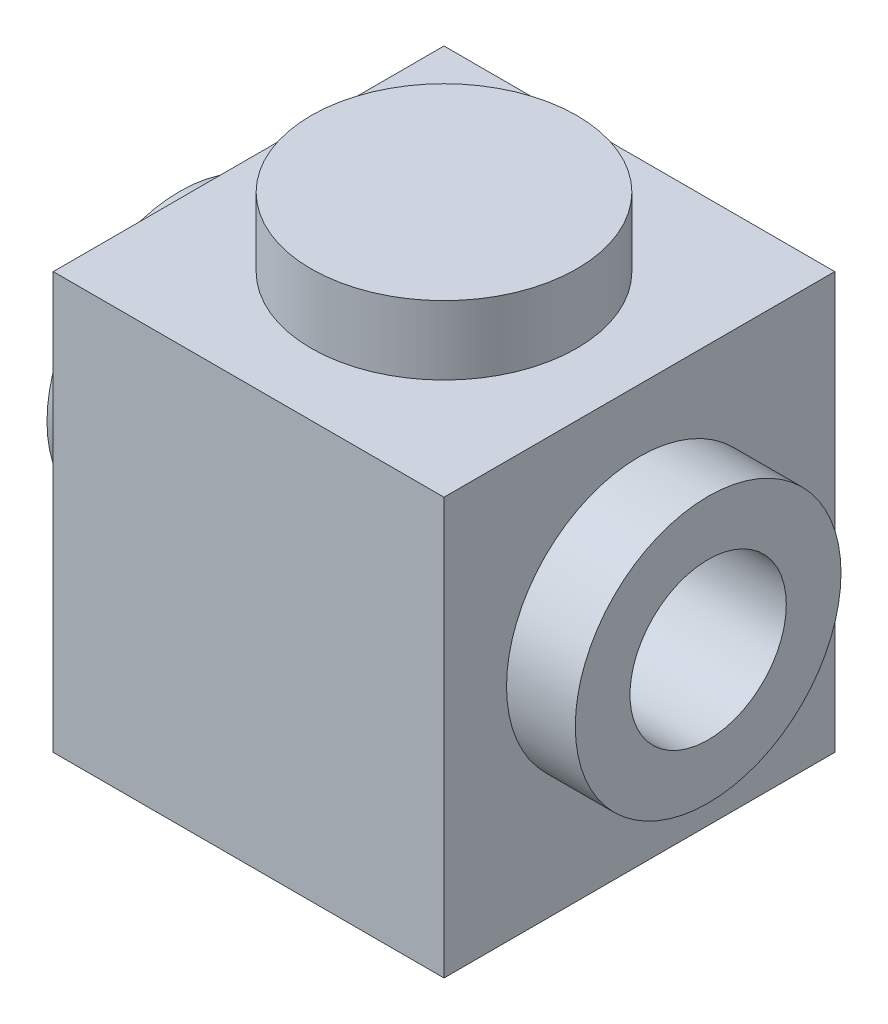
ISO-10303-21;
HEADER;
FILE_DESCRIPTION(('STEP AP214'),'2;1');
FILE_NAME('part.step','',(''),(''),'','','');
FILE_SCHEMA(('AUTOMOTIVE_DESIGN { 1 0 10303 214 1 1 1 1 }'));
ENDSEC;
DATA;
#1=APPLICATION_CONTEXT('core data for automotive mechanical design processes');
#2=APPLICATION_PROTOCOL_DEFINITION('international standard','automotive_design',2000,#1);
#3=PRODUCT_CONTEXT('',#1,'mechanical');
#4=PRODUCT('Part','Part','',(#3));
#5=PRODUCT_RELATED_PRODUCT_CATEGORY('part','',(#4));
#6=PRODUCT_DEFINITION_FORMATION('','',#4);
#7=PRODUCT_DEFINITION_CONTEXT('part definition',#1,'design');
#8=PRODUCT_DEFINITION('design','',#6,#7);
#9=PRODUCT_DEFINITION_SHAPE('','',#8);
#10=(LENGTH_UNIT() NAMED_UNIT(*) SI_UNIT(.MILLI.,.METRE.));
#11=(NAMED_UNIT(*) PLANE_ANGLE_UNIT() SI_UNIT($,.RADIAN.));
#12=(NAMED_UNIT(*) SI_UNIT($,.STERADIAN.) SOLID_ANGLE_UNIT());
#13=UNCERTAINTY_MEASURE_WITH_UNIT(LENGTH_MEASURE(1.E-05),#10,'distance_accuracy_value','');
#14=(GEOMETRIC_REPRESENTATION_CONTEXT(3) GLOBAL_UNCERTAINTY_ASSIGNED_CONTEXT((#13)) GLOBAL_UNIT_ASSIGNED_CONTEXT((#10,
#11,#12)) REPRESENTATION_CONTEXT('',''));
#15=CARTESIAN_POINT('',(0.,0.,0.));
#16=DIRECTION('',(0.,0.,1.));
#17=DIRECTION('',(1.,0.,0.));
#18=AXIS2_PLACEMENT_3D('',#15,#16,#17);
#19=CARTESIAN_POINT('',(3.96875,4.2291,-3.96875));
#20=DIRECTION('',(-1.,0.,0.));
#21=DIRECTION('',(0.,0.,1.));
#22=AXIS2_PLACEMENT_3D('',#19,#20,#21);
#23=PLANE('',#22);
#24=DIRECTION('',(0.,0.,-1.));
#25=VECTOR('',#24,1.);
#26=CARTESIAN_POINT('',(3.96875,-4.2291,-3.96875));
#27=LINE('',#26,#25);
#28=CARTESIAN_POINT('',(3.96875,-4.2291,3.96875));
#29=VERTEX_POINT('',#28);
#30=CARTESIAN_POINT('',(3.96875,-4.2291,-3.96875));
#31=VERTEX_POINT('',#30);
#32=EDGE_CURVE('E190',#29,#31,#27,.T.);
#33=ORIENTED_EDGE('',*,*,#32,.T.);
#34=DIRECTION('',(0.,-1.,0.));
#35=VECTOR('',#34,1.);
#36=CARTESIAN_POINT('',(3.96875,4.2291,-3.96875));
#37=LINE('',#36,#35);
#38=CARTESIAN_POINT('',(3.96875,4.2291,-3.96875));
#39=VERTEX_POINT('',#38);
#40=EDGE_CURVE('E63',#39,#31,#37,.T.);
#41=ORIENTED_EDGE('',*,*,#40,.F.);
#42=DIRECTION('',(0.,0.,-1.));
#43=VECTOR('',#42,1.);
#44=CARTESIAN_POINT('',(3.96875,4.2291,-3.96875));
#45=LINE('',#44,#43);
#46=CARTESIAN_POINT('',(3.96875,4.2291,3.96875));
#47=VERTEX_POINT('',#46);
#48=EDGE_CURVE('E191',#47,#39,#45,.T.);
#49=ORIENTED_EDGE('',*,*,#48,.F.);
#50=DIRECTION('',(0.,-1.,0.));
#51=VECTOR('',#50,1.);
#52=CARTESIAN_POINT('',(3.96875,4.2291,3.96875));
#53=LINE('',#52,#51);
#54=EDGE_CURVE('E200',#47,#29,#53,.T.);
#55=ORIENTED_EDGE('',*,*,#54,.T.);
#56=EDGE_LOOP('',(#33,#41,#49,#55));
#57=FACE_BOUND('',#56,.T.);
#58=CARTESIAN_POINT('',(3.96875,0.260349999999999,0.));
#59=DIRECTION('',(-1.,0.,0.));
#60=DIRECTION('',(0.,0.,1.));
#61=AXIS2_PLACEMENT_3D('',#58,#59,#60);
#62=CIRCLE('',#61,2.69875);
#63=CARTESIAN_POINT('',(3.96875,0.260349999999999,2.69875));
#64=VERTEX_POINT('',#63);
#65=EDGE_CURVE('E14',#64,#64,#62,.F.);
#66=ORIENTED_EDGE('',*,*,#65,.F.);
#67=EDGE_LOOP('',(#66));
#68=FACE_BOUND('',#67,.T.);
#69=ADVANCED_FACE('F55',(#57,#68),#23,.F.);
#70=CARTESIAN_POINT('',(3.96875,4.2291,3.96875));
#71=DIRECTION('',(0.,1.,0.));
#72=DIRECTION('',(0.,0.,1.));
#73=AXIS2_PLACEMENT_3D('',#70,#71,#72);
#74=PLANE('',#73);
#75=ORIENTED_EDGE('',*,*,#48,.T.);
#76=DIRECTION('',(-1.,0.,0.));
#77=VECTOR('',#76,1.);
#78=CARTESIAN_POINT('',(-3.96875,4.2291,-3.96874999999998));
#79=LINE('',#78,#77);
#80=CARTESIAN_POINT('',(-3.96875,4.2291,-3.96874999999998));
#81=VERTEX_POINT('',#80);
#82=EDGE_CURVE('E120',#39,#81,#79,.T.);
#83=ORIENTED_EDGE('',*,*,#82,.T.);
#84=DIRECTION('',(0.,0.,1.));
#85=VECTOR('',#84,1.);
#86=CARTESIAN_POINT('',(-3.96875,4.2291,-3.96874999999998));
#87=LINE('',#86,#85);
#88=CARTESIAN_POINT('',(-3.96875,4.2291,3.96874999999998));
#89=VERTEX_POINT('',#88);
#90=EDGE_CURVE('E195',#81,#89,#87,.T.);
#91=ORIENTED_EDGE('',*,*,#90,.T.);
#92=DIRECTION('',(1.,0.,0.));
#93=VECTOR('',#92,1.);
#94=CARTESIAN_POINT('',(-3.96875,4.2291,3.96874999999998));
#95=LINE('',#94,#93);
#96=EDGE_CURVE('E84',#89,#47,#95,.T.);
#97=ORIENTED_EDGE('',*,*,#96,.T.);
#98=EDGE_LOOP('',(#75,#83,#91,#97));
#99=FACE_BOUND('',#98,.T.);
#100=CARTESIAN_POINT('',(0.,4.2291,0.));
#101=DIRECTION('',(0.,1.,0.));
#102=DIRECTION('',(0.,0.,1.));
#103=AXIS2_PLACEMENT_3D('',#100,#101,#102);
#104=CIRCLE('',#103,2.69875);
#105=CARTESIAN_POINT('',(0.,4.2291,2.69875));
#106=VERTEX_POINT('',#105);
#107=EDGE_CURVE('E241',#106,#106,#104,.T.);
#108=ORIENTED_EDGE('',*,*,#107,.F.);
#109=EDGE_LOOP('',(#108));
#110=FACE_BOUND('',#109,.T.);
#111=ADVANCED_FACE('F235',(#99,#110),#74,.T.);
#112=CARTESIAN_POINT('',(-3.96875,4.2291,-3.96874999999998));
#113=DIRECTION('',(0.,0.,1.));
#114=DIRECTION('',(1.,0.,0.));
#115=AXIS2_PLACEMENT_3D('',#112,#113,#114);
#116=PLANE('',#115);
#117=DIRECTION('',(-1.,0.,0.));
#118=VECTOR('',#117,1.);
#119=CARTESIAN_POINT('',(-3.96875,-4.2291,-3.96874999999998));
#120=LINE('',#119,#118);
#121=CARTESIAN_POINT('',(-3.96875,-4.2291,-3.96874999999998));
#122=VERTEX_POINT('',#121);
#123=EDGE_CURVE('E204',#31,#122,#120,.T.);
#124=ORIENTED_EDGE('',*,*,#123,.T.);
#125=DIRECTION('',(0.,-1.,0.));
#126=VECTOR('',#125,1.);
#127=CARTESIAN_POINT('',(-3.96875,4.2291,-3.96874999999998));
#128=LINE('',#127,#126);
#129=EDGE_CURVE('E217',#81,#122,#128,.T.);
#130=ORIENTED_EDGE('',*,*,#129,.F.);
#131=ORIENTED_EDGE('',*,*,#82,.F.);
#132=ORIENTED_EDGE('',*,*,#40,.T.);
#133=EDGE_LOOP('',(#124,#130,#131,#132));
#134=FACE_BOUND('',#133,.T.);
#135=ADVANCED_FACE('F222',(#134),#116,.F.);
#136=CARTESIAN_POINT('',(-3.96875,4.2291,-3.96874999999998));
#137=DIRECTION('',(1.,0.,0.));
#138=DIRECTION('',(0.,0.,-1.));
#139=AXIS2_PLACEMENT_3D('',#136,#137,#138);
#140=PLANE('',#139);
#141=CARTESIAN_POINT('',(-3.96875,0.260349999999999,0.));
#142=DIRECTION('',(1.,0.,0.));
#143=DIRECTION('',(0.,0.,-1.));
#144=AXIS2_PLACEMENT_3D('',#141,#142,#143);
#145=CIRCLE('',#144,2.69875);
#146=CARTESIAN_POINT('',(-3.96875,0.260349999999999,-2.69875));
#147=VERTEX_POINT('',#146);
#148=EDGE_CURVE('E412',#147,#147,#145,.T.);
#149=ORIENTED_EDGE('',*,*,#148,.T.);
#150=EDGE_LOOP('',(#149));
#151=FACE_BOUND('',#150,.T.);
#152=DIRECTION('',(0.,0.,1.));
#153=VECTOR('',#152,1.);
#154=CARTESIAN_POINT('',(-3.96875,-4.2291,-3.96874999999998));
#155=LINE('',#154,#153);
#156=CARTESIAN_POINT('',(-3.96875,-4.2291,3.96874999999998));
#157=VERTEX_POINT('',#156);
#158=EDGE_CURVE('E207',#122,#157,#155,.T.);
#159=ORIENTED_EDGE('',*,*,#158,.T.);
#160=DIRECTION('',(0.,-1.,0.));
#161=VECTOR('',#160,1.);
#162=CARTESIAN_POINT('',(-3.96875,4.2291,3.96874999999998));
#163=LINE('',#162,#161);
#164=EDGE_CURVE('E214',#89,#157,#163,.T.);
#165=ORIENTED_EDGE('',*,*,#164,.F.);
#166=ORIENTED_EDGE('',*,*,#90,.F.);
#167=ORIENTED_EDGE('',*,*,#129,.T.);
#168=EDGE_LOOP('',(#159,#165,#166,#167));
#169=FACE_BOUND('',#168,.T.);
#170=ADVANCED_FACE('F232',(#151,#169),#140,.F.);
#171=CARTESIAN_POINT('',(-3.96875,4.2291,3.96874999999998));
#172=DIRECTION('',(0.,0.,-1.));
#173=DIRECTION('',(-1.,0.,0.));
#174=AXIS2_PLACEMENT_3D('',#171,#172,#173);
#175=PLANE('',#174);
#176=DIRECTION('',(1.,0.,0.));
#177=VECTOR('',#176,1.);
#178=CARTESIAN_POINT('',(-3.96875,-4.2291,3.96874999999998));
#179=LINE('',#178,#177);
#180=EDGE_CURVE('E109',#157,#29,#179,.T.);
#181=ORIENTED_EDGE('',*,*,#180,.T.);
#182=ORIENTED_EDGE('',*,*,#54,.F.);
#183=ORIENTED_EDGE('',*,*,#96,.F.);
#184=ORIENTED_EDGE('',*,*,#164,.T.);
#185=EDGE_LOOP('',(#181,#182,#183,#184));
#186=FACE_BOUND('',#185,.T.);
#187=ADVANCED_FACE('F234',(#186),#175,.F.);
#188=CARTESIAN_POINT('',(3.96875,-4.2291,3.96875));
#189=DIRECTION('',(0.,1.,0.));
#190=DIRECTION('',(0.,0.,1.));
#191=AXIS2_PLACEMENT_3D('',#188,#189,#190);
#192=PLANE('',#191);
#193=DIRECTION('',(0.,0.,1.));
#194=VECTOR('',#193,1.);
#195=CARTESIAN_POINT('',(2.69875,-4.2291,-8.87267135623731));
#196=LINE('',#195,#194);
#197=CARTESIAN_POINT('',(2.69875,-4.2291,-2.69875));
#198=VERTEX_POINT('',#197);
#199=CARTESIAN_POINT('',(2.69875,-4.2291,2.69875));
#200=VERTEX_POINT('',#199);
#201=EDGE_CURVE('E171',#198,#200,#196,.T.);
#202=ORIENTED_EDGE('',*,*,#201,.F.);
#203=DIRECTION('',(1.,0.,0.));
#204=VECTOR('',#203,1.);
#205=CARTESIAN_POINT('',(0.,-4.2291,-2.69875));
#206=LINE('',#205,#204);
#207=CARTESIAN_POINT('',(-2.69875,-4.2291,-2.69875000000001));
#208=VERTEX_POINT('',#207);
#209=EDGE_CURVE('E160',#208,#198,#206,.T.);
#210=ORIENTED_EDGE('',*,*,#209,.F.);
#211=DIRECTION('',(0.,0.,-1.));
#212=VECTOR('',#211,1.);
#213=CARTESIAN_POINT('',(-2.69875,-4.2291,-8.87267135623731));
#214=LINE('',#213,#212);
#215=CARTESIAN_POINT('',(-2.69875,-4.2291,2.69874999999999));
#216=VERTEX_POINT('',#215);
#217=EDGE_CURVE('E175',#216,#208,#214,.T.);
#218=ORIENTED_EDGE('',*,*,#217,.F.);
#219=DIRECTION('',(-1.,0.,0.));
#220=VECTOR('',#219,1.);
#221=CARTESIAN_POINT('',(0.,-4.2291,2.69875));
#222=LINE('',#221,#220);
#223=EDGE_CURVE('E72',#200,#216,#222,.T.);
#224=ORIENTED_EDGE('',*,*,#223,.F.);
#225=EDGE_LOOP('',(#202,#210,#218,#224));
#226=FACE_BOUND('',#225,.T.);
#227=ORIENTED_EDGE('',*,*,#32,.F.);
#228=ORIENTED_EDGE('',*,*,#180,.F.);
#229=ORIENTED_EDGE('',*,*,#158,.F.);
#230=ORIENTED_EDGE('',*,*,#123,.F.);
#231=EDGE_LOOP('',(#227,#228,#229,#230));
#232=FACE_BOUND('',#231,.T.);
#233=ADVANCED_FACE('F228',(#226,#232),#192,.F.);
#234=CARTESIAN_POINT('',(3.96875,2.9591,3.96875));
#235=DIRECTION('',(0.,1.,0.));
#236=DIRECTION('',(0.,0.,1.));
#237=AXIS2_PLACEMENT_3D('',#234,#235,#236);
#238=PLANE('',#237);
#239=DIRECTION('',(0.,0.,-1.));
#240=VECTOR('',#239,1.);
#241=CARTESIAN_POINT('',(-2.69875,2.9591,-8.87267135623731));
#242=LINE('',#241,#240);
#243=CARTESIAN_POINT('',(-2.69875,2.9591,2.69874999999999));
#244=VERTEX_POINT('',#243);
#245=CARTESIAN_POINT('',(-2.69875,2.9591,-2.69875000000001));
#246=VERTEX_POINT('',#245);
#247=EDGE_CURVE('E165',#244,#246,#242,.T.);
#248=ORIENTED_EDGE('',*,*,#247,.T.);
#249=DIRECTION('',(1.,0.,0.));
#250=VECTOR('',#249,1.);
#251=CARTESIAN_POINT('',(0.,2.9591,-2.69875));
#252=LINE('',#251,#250);
#253=CARTESIAN_POINT('',(2.69875,2.9591,-2.69875));
#254=VERTEX_POINT('',#253);
#255=EDGE_CURVE('E157',#246,#254,#252,.T.);
#256=ORIENTED_EDGE('',*,*,#255,.T.);
#257=DIRECTION('',(0.,0.,1.));
#258=VECTOR('',#257,1.);
#259=CARTESIAN_POINT('',(2.69875,2.9591,-8.87267135623731));
#260=LINE('',#259,#258);
#261=CARTESIAN_POINT('',(2.69875,2.9591,2.69875));
#262=VERTEX_POINT('',#261);
#263=EDGE_CURVE('E143',#254,#262,#260,.T.);
#264=ORIENTED_EDGE('',*,*,#263,.T.);
#265=DIRECTION('',(-1.,0.,0.));
#266=VECTOR('',#265,1.);
#267=CARTESIAN_POINT('',(0.,2.9591,2.69875));
#268=LINE('',#267,#266);
#269=EDGE_CURVE('E181',#262,#244,#268,.T.);
#270=ORIENTED_EDGE('',*,*,#269,.T.);
#271=EDGE_LOOP('',(#248,#256,#264,#270));
#272=FACE_BOUND('',#271,.T.);
#273=ADVANCED_FACE('F164',(#272),#238,.F.);
#274=CARTESIAN_POINT('',(0.,11.8623177029088,-2.69875));
#275=DIRECTION('',(0.,0.,-1.));
#276=DIRECTION('',(-1.,0.,0.));
#277=AXIS2_PLACEMENT_3D('',#274,#275,#276);
#278=PLANE('',#277);
#279=DIRECTION('',(0.,-1.,0.));
#280=VECTOR('',#279,1.);
#281=CARTESIAN_POINT('',(-2.69875,11.8623177029088,-2.69875000000001));
#282=LINE('',#281,#280);
#283=EDGE_CURVE('E179',#246,#208,#282,.T.);
#284=ORIENTED_EDGE('',*,*,#283,.T.);
#285=ORIENTED_EDGE('',*,*,#209,.T.);
#286=DIRECTION('',(0.,-1.,0.));
#287=VECTOR('',#286,1.);
#288=CARTESIAN_POINT('',(2.69875,11.8623177029088,-2.69875));
#289=LINE('',#288,#287);
#290=EDGE_CURVE('E147',#254,#198,#289,.T.);
#291=ORIENTED_EDGE('',*,*,#290,.F.);
#292=ORIENTED_EDGE('',*,*,#255,.F.);
#293=EDGE_LOOP('',(#284,#285,#291,#292));
#294=FACE_BOUND('',#293,.T.);
#295=ADVANCED_FACE('F156',(#294),#278,.F.);
#296=CARTESIAN_POINT('',(2.69875,11.8623177029088,-8.87267135623731));
#297=DIRECTION('',(1.,0.,0.));
#298=DIRECTION('',(0.,0.,-1.));
#299=AXIS2_PLACEMENT_3D('',#296,#297,#298);
#300=PLANE('',#299);
#301=CARTESIAN_POINT('',(2.69875,0.260349999999999,0.));
#302=DIRECTION('',(1.,0.,0.));
#303=DIRECTION('',(0.,0.,-1.));
#304=AXIS2_PLACEMENT_3D('',#301,#302,#303);
#305=CIRCLE('',#304,1.5875);
#306=CARTESIAN_POINT('',(2.69875,0.260349999999999,-1.5875));
#307=VERTEX_POINT('',#306);
#308=EDGE_CURVE('E409',#307,#307,#305,.T.);
#309=ORIENTED_EDGE('',*,*,#308,.T.);
#310=EDGE_LOOP('',(#309));
#311=FACE_BOUND('',#310,.T.);
#312=ORIENTED_EDGE('',*,*,#290,.T.);
#313=ORIENTED_EDGE('',*,*,#201,.T.);
#314=DIRECTION('',(0.,-1.,0.));
#315=VECTOR('',#314,1.);
#316=CARTESIAN_POINT('',(2.69875,11.8623177029088,2.69875));
#317=LINE('',#316,#315);
#318=EDGE_CURVE('E149',#262,#200,#317,.T.);
#319=ORIENTED_EDGE('',*,*,#318,.F.);
#320=ORIENTED_EDGE('',*,*,#263,.F.);
#321=EDGE_LOOP('',(#312,#313,#319,#320));
#322=FACE_BOUND('',#321,.T.);
#323=ADVANCED_FACE('F145',(#311,#322),#300,.F.);
#324=CARTESIAN_POINT('',(0.,11.8623177029088,2.69875));
#325=DIRECTION('',(0.,0.,1.));
#326=DIRECTION('',(1.,0.,0.));
#327=AXIS2_PLACEMENT_3D('',#324,#325,#326);
#328=PLANE('',#327);
#329=ORIENTED_EDGE('',*,*,#318,.T.);
#330=ORIENTED_EDGE('',*,*,#223,.T.);
#331=DIRECTION('',(0.,-1.,0.));
#332=VECTOR('',#331,1.);
#333=CARTESIAN_POINT('',(-2.69875,11.8623177029088,2.69874999999999));
#334=LINE('',#333,#332);
#335=EDGE_CURVE('E180',#244,#216,#334,.T.);
#336=ORIENTED_EDGE('',*,*,#335,.F.);
#337=ORIENTED_EDGE('',*,*,#269,.F.);
#338=EDGE_LOOP('',(#329,#330,#336,#337));
#339=FACE_BOUND('',#338,.T.);
#340=ADVANCED_FACE('F300',(#339),#328,.F.);
#341=CARTESIAN_POINT('',(-2.69875,11.8623177029088,-8.87267135623731));
#342=DIRECTION('',(-1.,0.,0.));
#343=DIRECTION('',(0.,0.,1.));
#344=AXIS2_PLACEMENT_3D('',#341,#342,#343);
#345=PLANE('',#344);
#346=CARTESIAN_POINT('',(-2.69875,0.260349999999999,0.));
#347=DIRECTION('',(-1.,0.,0.));
#348=DIRECTION('',(0.,0.,1.));
#349=AXIS2_PLACEMENT_3D('',#346,#347,#348);
#350=CIRCLE('',#349,1.5875);
#351=CARTESIAN_POINT('',(-2.69875,0.260349999999999,1.5875));
#352=VERTEX_POINT('',#351);
#353=EDGE_CURVE('E413',#352,#352,#350,.T.);
#354=ORIENTED_EDGE('',*,*,#353,.T.);
#355=EDGE_LOOP('',(#354));
#356=FACE_BOUND('',#355,.T.);
#357=ORIENTED_EDGE('',*,*,#335,.T.);
#358=ORIENTED_EDGE('',*,*,#217,.T.);
#359=ORIENTED_EDGE('',*,*,#283,.F.);
#360=ORIENTED_EDGE('',*,*,#247,.F.);
#361=EDGE_LOOP('',(#357,#358,#359,#360));
#362=FACE_BOUND('',#361,.T.);
#363=ADVANCED_FACE('F260',(#356,#362),#345,.F.);
#364=CARTESIAN_POINT('',(0.,5.6261,0.));
#365=DIRECTION('',(0.,-1.,0.));
#366=DIRECTION('',(0.,0.,-1.));
#367=AXIS2_PLACEMENT_3D('',#364,#365,#366);
#368=CYLINDRICAL_SURFACE('',#367,2.69875);
#369=CARTESIAN_POINT('',(0.,5.6261,0.));
#370=DIRECTION('',(0.,1.,0.));
#371=DIRECTION('',(0.,0.,1.));
#372=AXIS2_PLACEMENT_3D('',#369,#370,#371);
#373=CIRCLE('',#372,2.69875);
#374=CARTESIAN_POINT('',(0.,5.6261,2.69875));
#375=VERTEX_POINT('',#374);
#376=EDGE_CURVE('E244',#375,#375,#373,.T.);
#377=ORIENTED_EDGE('',*,*,#376,.F.);
#378=EDGE_LOOP('',(#377));
#379=FACE_BOUND('',#378,.T.);
#380=ORIENTED_EDGE('',*,*,#107,.T.);
#381=EDGE_LOOP('',(#380));
#382=FACE_BOUND('',#381,.T.);
#383=ADVANCED_FACE('F358',(#379,#382),#368,.T.);
#384=CARTESIAN_POINT('',(0.,5.6261,0.));
#385=DIRECTION('',(0.,1.,0.));
#386=DIRECTION('',(0.,0.,1.));
#387=AXIS2_PLACEMENT_3D('',#384,#385,#386);
#388=PLANE('',#387);
#389=ORIENTED_EDGE('',*,*,#376,.T.);
#390=EDGE_LOOP('',(#389));
#391=FACE_BOUND('',#390,.T.);
#392=ADVANCED_FACE('F351',(#391),#388,.T.);
#393=CARTESIAN_POINT('',(5.36575,0.260349999999999,0.));
#394=DIRECTION('',(-1.,0.,0.));
#395=DIRECTION('',(0.,0.,1.));
#396=AXIS2_PLACEMENT_3D('',#393,#394,#395);
#397=CYLINDRICAL_SURFACE('',#396,2.69875);
#398=CARTESIAN_POINT('',(5.36575,0.260349999999999,0.));
#399=DIRECTION('',(1.,0.,0.));
#400=DIRECTION('',(0.,0.,-1.));
#401=AXIS2_PLACEMENT_3D('',#398,#399,#400);
#402=CIRCLE('',#401,2.69875);
#403=CARTESIAN_POINT('',(5.36575,0.260349999999999,-2.69875));
#404=VERTEX_POINT('',#403);
#405=EDGE_CURVE('E245',#404,#404,#402,.T.);
#406=ORIENTED_EDGE('',*,*,#405,.F.);
#407=EDGE_LOOP('',(#406));
#408=FACE_BOUND('',#407,.T.);
#409=ORIENTED_EDGE('',*,*,#65,.T.);
#410=EDGE_LOOP('',(#409));
#411=FACE_BOUND('',#410,.T.);
#412=ADVANCED_FACE('F345',(#408,#411),#397,.T.);
#413=CARTESIAN_POINT('',(5.36575,0.260349999999999,0.));
#414=DIRECTION('',(1.,0.,0.));
#415=DIRECTION('',(0.,0.,-1.));
#416=AXIS2_PLACEMENT_3D('',#413,#414,#415);
#417=PLANE('',#416);
#418=CARTESIAN_POINT('',(5.36575,0.260349999999999,0.));
#419=DIRECTION('',(1.,0.,0.));
#420=DIRECTION('',(0.,0.,-1.));
#421=AXIS2_PLACEMENT_3D('',#418,#419,#420);
#422=CIRCLE('',#421,1.5875);
#423=CARTESIAN_POINT('',(5.36575,0.260349999999999,-1.5875));
#424=VERTEX_POINT('',#423);
#425=EDGE_CURVE('E429',#424,#424,#422,.T.);
#426=ORIENTED_EDGE('',*,*,#425,.F.);
#427=EDGE_LOOP('',(#426));
#428=FACE_BOUND('',#427,.T.);
#429=ORIENTED_EDGE('',*,*,#405,.T.);
#430=EDGE_LOOP('',(#429));
#431=FACE_BOUND('',#430,.T.);
#432=ADVANCED_FACE('F339',(#428,#431),#417,.T.);
#433=CARTESIAN_POINT('',(-5.36575,0.260349999999999,0.));
#434=DIRECTION('',(1.,0.,0.));
#435=DIRECTION('',(0.,0.,-1.));
#436=AXIS2_PLACEMENT_3D('',#433,#434,#435);
#437=CYLINDRICAL_SURFACE('',#436,2.69875);
#438=CARTESIAN_POINT('',(-5.36575,0.260349999999999,0.));
#439=DIRECTION('',(1.,0.,0.));
#440=DIRECTION('',(0.,0.,-1.));
#441=AXIS2_PLACEMENT_3D('',#438,#439,#440);
#442=CIRCLE('',#441,2.69875);
#443=CARTESIAN_POINT('',(-5.36575,0.260349999999999,-2.69875));
#444=VERTEX_POINT('',#443);
#445=EDGE_CURVE('E252',#444,#444,#442,.T.);
#446=ORIENTED_EDGE('',*,*,#445,.T.);
#447=EDGE_LOOP('',(#446));
#448=FACE_BOUND('',#447,.T.);
#449=ORIENTED_EDGE('',*,*,#148,.F.);
#450=EDGE_LOOP('',(#449));
#451=FACE_BOUND('',#450,.T.);
#452=ADVANCED_FACE('F331',(#448,#451),#437,.T.);
#453=CARTESIAN_POINT('',(-5.36575,0.260349999999999,0.));
#454=DIRECTION('',(-1.,0.,0.));
#455=DIRECTION('',(0.,0.,-1.));
#456=AXIS2_PLACEMENT_3D('',#453,#454,#455);
#457=PLANE('',#456);
#458=CARTESIAN_POINT('',(-5.36575,0.260349999999999,0.));
#459=DIRECTION('',(1.,0.,0.));
#460=DIRECTION('',(0.,0.,-1.));
#461=AXIS2_PLACEMENT_3D('',#458,#459,#460);
#462=CIRCLE('',#461,1.5875);
#463=CARTESIAN_POINT('',(-5.36575,0.260349999999999,-1.5875));
#464=VERTEX_POINT('',#463);
#465=EDGE_CURVE('E419',#464,#464,#462,.T.);
#466=ORIENTED_EDGE('',*,*,#465,.T.);
#467=EDGE_LOOP('',(#466));
#468=FACE_BOUND('',#467,.T.);
#469=ORIENTED_EDGE('',*,*,#445,.F.);
#470=EDGE_LOOP('',(#469));
#471=FACE_BOUND('',#470,.T.);
#472=ADVANCED_FACE('F325',(#468,#471),#457,.T.);
#473=CARTESIAN_POINT('',(-5.36575,0.260349999999999,0.));
#474=DIRECTION('',(1.,0.,0.));
#475=DIRECTION('',(0.,0.,-1.));
#476=AXIS2_PLACEMENT_3D('',#473,#474,#475);
#477=CYLINDRICAL_SURFACE('',#476,1.5875);
#478=ORIENTED_EDGE('',*,*,#465,.F.);
#479=EDGE_LOOP('',(#478));
#480=FACE_BOUND('',#479,.T.);
#481=ORIENTED_EDGE('',*,*,#353,.F.);
#482=EDGE_LOOP('',(#481));
#483=FACE_BOUND('',#482,.T.);
#484=ADVANCED_FACE('F314',(#480,#483),#477,.F.);
#485=ORIENTED_EDGE('',*,*,#425,.T.);
#486=EDGE_LOOP('',(#485));
#487=FACE_BOUND('',#486,.T.);
#488=ORIENTED_EDGE('',*,*,#308,.F.);
#489=EDGE_LOOP('',(#488));
#490=FACE_BOUND('',#489,.T.);
#491=ADVANCED_FACE('F311',(#487,#490),#477,.F.);
#492=CLOSED_SHELL('',(#69,#111,#135,#170,#187,#233,#273,#295,#323,#340,#363,#383,#392,#412,#432,
#452,#472,#484,#491));
#493=MANIFOLD_SOLID_BREP('B2',#492);
#494=ADVANCED_BREP_SHAPE_REPRESENTATION('',(#18,#493),#14);
#495=SHAPE_DEFINITION_REPRESENTATION(#9,#494);
ENDSEC;
END-ISO-10303-21;
